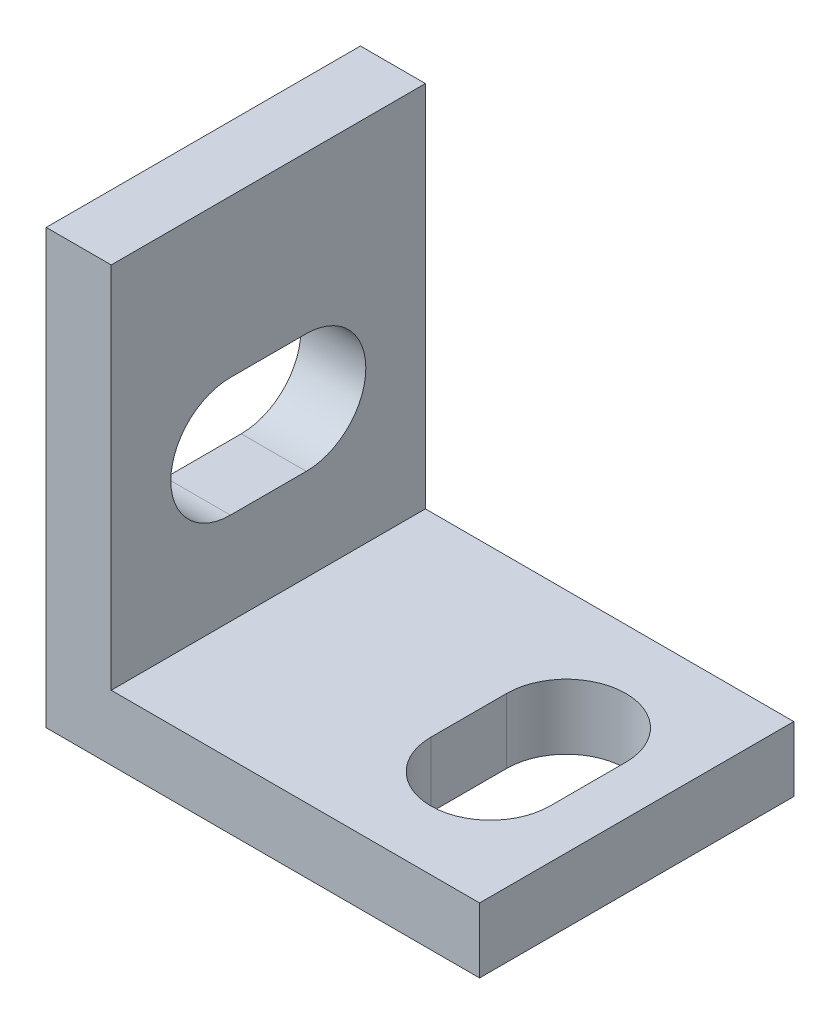
ISO-10303-21;
HEADER;
FILE_DESCRIPTION(('STEP AP214'),'2;1');
FILE_NAME('part.step','',(''),(''),'','','');
FILE_SCHEMA(('AUTOMOTIVE_DESIGN { 1 0 10303 214 1 1 1 1 }'));
ENDSEC;
DATA;
#1=APPLICATION_CONTEXT('core data for automotive mechanical design processes');
#2=APPLICATION_PROTOCOL_DEFINITION('international standard','automotive_design',2000,#1);
#3=PRODUCT_CONTEXT('',#1,'mechanical');
#4=PRODUCT('Part','Part','',(#3));
#5=PRODUCT_RELATED_PRODUCT_CATEGORY('part','',(#4));
#6=PRODUCT_DEFINITION_FORMATION('','',#4);
#7=PRODUCT_DEFINITION_CONTEXT('part definition',#1,'design');
#8=PRODUCT_DEFINITION('design','',#6,#7);
#9=PRODUCT_DEFINITION_SHAPE('','',#8);
#10=(LENGTH_UNIT() NAMED_UNIT(*) SI_UNIT(.MILLI.,.METRE.));
#11=(NAMED_UNIT(*) PLANE_ANGLE_UNIT() SI_UNIT($,.RADIAN.));
#12=(NAMED_UNIT(*) SI_UNIT($,.STERADIAN.) SOLID_ANGLE_UNIT());
#13=UNCERTAINTY_MEASURE_WITH_UNIT(LENGTH_MEASURE(1.E-05),#10,'distance_accuracy_value','');
#14=(GEOMETRIC_REPRESENTATION_CONTEXT(3) GLOBAL_UNCERTAINTY_ASSIGNED_CONTEXT((#13)) GLOBAL_UNIT_ASSIGNED_CONTEXT((#10,
#11,#12)) REPRESENTATION_CONTEXT('',''));
#15=CARTESIAN_POINT('',(0.,0.,0.));
#16=DIRECTION('',(0.,0.,1.));
#17=DIRECTION('',(1.,0.,0.));
#18=AXIS2_PLACEMENT_3D('',#15,#16,#17);
#19=CARTESIAN_POINT('',(0.,0.,14.5));
#20=DIRECTION('',(0.,1.,0.));
#21=DIRECTION('',(0.,0.,1.));
#22=AXIS2_PLACEMENT_3D('',#19,#20,#21);
#23=PLANE('',#22);
#24=DIRECTION('',(0.,0.,1.));
#25=VECTOR('',#24,1.);
#26=CARTESIAN_POINT('',(12.25,0.,9.));
#27=LINE('',#26,#25);
#28=CARTESIAN_POINT('',(12.25,0.,5.5));
#29=VERTEX_POINT('',#28);
#30=CARTESIAN_POINT('',(12.25,0.,9.));
#31=VERTEX_POINT('',#30);
#32=EDGE_CURVE('E142',#29,#31,#27,.T.);
#33=ORIENTED_EDGE('',*,*,#32,.T.);
#34=CARTESIAN_POINT('',(15.,0.,9.));
#35=DIRECTION('',(0.,1.,0.));
#36=DIRECTION('',(0.,0.,1.));
#37=AXIS2_PLACEMENT_3D('',#34,#35,#36);
#38=CIRCLE('',#37,2.75);
#39=CARTESIAN_POINT('',(17.75,0.,9.));
#40=VERTEX_POINT('',#39);
#41=EDGE_CURVE('E136',#31,#40,#38,.T.);
#42=ORIENTED_EDGE('',*,*,#41,.T.);
#43=DIRECTION('',(0.,0.,-1.));
#44=VECTOR('',#43,1.);
#45=CARTESIAN_POINT('',(17.75,0.,9.));
#46=LINE('',#45,#44);
#47=CARTESIAN_POINT('',(17.75,0.,5.5));
#48=VERTEX_POINT('',#47);
#49=EDGE_CURVE('E145',#40,#48,#46,.T.);
#50=ORIENTED_EDGE('',*,*,#49,.T.);
#51=CARTESIAN_POINT('',(15.,0.,5.5));
#52=DIRECTION('',(0.,1.,0.));
#53=DIRECTION('',(0.,0.,1.));
#54=AXIS2_PLACEMENT_3D('',#51,#52,#53);
#55=CIRCLE('',#54,2.75);
#56=EDGE_CURVE('E49',#48,#29,#55,.T.);
#57=ORIENTED_EDGE('',*,*,#56,.T.);
#58=EDGE_LOOP('',(#33,#42,#50,#57));
#59=FACE_BOUND('',#58,.T.);
#60=DIRECTION('',(1.,0.,0.));
#61=VECTOR('',#60,1.);
#62=CARTESIAN_POINT('',(0.,0.,0.));
#63=LINE('',#62,#61);
#64=CARTESIAN_POINT('',(0.,0.,0.));
#65=VERTEX_POINT('',#64);
#66=CARTESIAN_POINT('',(20.,0.,0.));
#67=VERTEX_POINT('',#66);
#68=EDGE_CURVE('E195',#65,#67,#63,.T.);
#69=ORIENTED_EDGE('',*,*,#68,.T.);
#70=DIRECTION('',(0.,0.,-1.));
#71=VECTOR('',#70,1.);
#72=CARTESIAN_POINT('',(20.,0.,14.5));
#73=LINE('',#72,#71);
#74=CARTESIAN_POINT('',(20.,0.,14.5));
#75=VERTEX_POINT('',#74);
#76=EDGE_CURVE('E11',#75,#67,#73,.T.);
#77=ORIENTED_EDGE('',*,*,#76,.F.);
#78=DIRECTION('',(1.,0.,0.));
#79=VECTOR('',#78,1.);
#80=CARTESIAN_POINT('',(0.,0.,14.5));
#81=LINE('',#80,#79);
#82=CARTESIAN_POINT('',(0.,0.,14.5));
#83=VERTEX_POINT('',#82);
#84=EDGE_CURVE('E202',#83,#75,#81,.T.);
#85=ORIENTED_EDGE('',*,*,#84,.F.);
#86=DIRECTION('',(0.,0.,-1.));
#87=VECTOR('',#86,1.);
#88=CARTESIAN_POINT('',(0.,0.,14.5));
#89=LINE('',#88,#87);
#90=EDGE_CURVE('E219',#83,#65,#89,.T.);
#91=ORIENTED_EDGE('',*,*,#90,.T.);
#92=EDGE_LOOP('',(#69,#77,#85,#91));
#93=FACE_BOUND('',#92,.T.);
#94=ADVANCED_FACE('F35',(#59,#93),#23,.F.);
#95=CARTESIAN_POINT('',(20.,3.,14.5));
#96=DIRECTION('',(1.,0.,0.));
#97=DIRECTION('',(0.,0.,-1.));
#98=AXIS2_PLACEMENT_3D('',#95,#96,#97);
#99=PLANE('',#98);
#100=DIRECTION('',(0.,-1.,0.));
#101=VECTOR('',#100,1.);
#102=CARTESIAN_POINT('',(20.,3.,0.));
#103=LINE('',#102,#101);
#104=CARTESIAN_POINT('',(20.,3.,0.));
#105=VERTEX_POINT('',#104);
#106=EDGE_CURVE('E222',#105,#67,#103,.T.);
#107=ORIENTED_EDGE('',*,*,#106,.F.);
#108=DIRECTION('',(0.,0.,-1.));
#109=VECTOR('',#108,1.);
#110=CARTESIAN_POINT('',(20.,3.,14.5));
#111=LINE('',#110,#109);
#112=CARTESIAN_POINT('',(20.,3.,14.5));
#113=VERTEX_POINT('',#112);
#114=EDGE_CURVE('E42',#113,#105,#111,.T.);
#115=ORIENTED_EDGE('',*,*,#114,.F.);
#116=DIRECTION('',(0.,-1.,0.));
#117=VECTOR('',#116,1.);
#118=CARTESIAN_POINT('',(20.,3.,14.5));
#119=LINE('',#118,#117);
#120=EDGE_CURVE('E204',#113,#75,#119,.T.);
#121=ORIENTED_EDGE('',*,*,#120,.T.);
#122=ORIENTED_EDGE('',*,*,#76,.T.);
#123=EDGE_LOOP('',(#107,#115,#121,#122));
#124=FACE_BOUND('',#123,.T.);
#125=ADVANCED_FACE('F249',(#124),#99,.T.);
#126=CARTESIAN_POINT('',(0.,3.,14.5));
#127=DIRECTION('',(0.,1.,0.));
#128=DIRECTION('',(0.,0.,1.));
#129=AXIS2_PLACEMENT_3D('',#126,#127,#128);
#130=PLANE('',#129);
#131=CARTESIAN_POINT('',(15.,3.,9.));
#132=DIRECTION('',(0.,1.,0.));
#133=DIRECTION('',(0.,0.,1.));
#134=AXIS2_PLACEMENT_3D('',#131,#132,#133);
#135=CIRCLE('',#134,2.75);
#136=CARTESIAN_POINT('',(12.25,3.,9.));
#137=VERTEX_POINT('',#136);
#138=CARTESIAN_POINT('',(17.75,3.,9.));
#139=VERTEX_POINT('',#138);
#140=EDGE_CURVE('E57',#137,#139,#135,.T.);
#141=ORIENTED_EDGE('',*,*,#140,.F.);
#142=DIRECTION('',(0.,0.,1.));
#143=VECTOR('',#142,1.);
#144=CARTESIAN_POINT('',(12.25,3.,9.));
#145=LINE('',#144,#143);
#146=CARTESIAN_POINT('',(12.25,3.,5.5));
#147=VERTEX_POINT('',#146);
#148=EDGE_CURVE('E151',#147,#137,#145,.T.);
#149=ORIENTED_EDGE('',*,*,#148,.F.);
#150=CARTESIAN_POINT('',(15.,3.,5.5));
#151=DIRECTION('',(0.,1.,0.));
#152=DIRECTION('',(0.,0.,1.));
#153=AXIS2_PLACEMENT_3D('',#150,#151,#152);
#154=CIRCLE('',#153,2.75);
#155=CARTESIAN_POINT('',(17.75,3.,5.5));
#156=VERTEX_POINT('',#155);
#157=EDGE_CURVE('E154',#156,#147,#154,.T.);
#158=ORIENTED_EDGE('',*,*,#157,.F.);
#159=DIRECTION('',(0.,0.,-1.));
#160=VECTOR('',#159,1.);
#161=CARTESIAN_POINT('',(17.75,3.,9.));
#162=LINE('',#161,#160);
#163=EDGE_CURVE('E160',#139,#156,#162,.T.);
#164=ORIENTED_EDGE('',*,*,#163,.F.);
#165=EDGE_LOOP('',(#141,#149,#158,#164));
#166=FACE_BOUND('',#165,.T.);
#167=DIRECTION('',(1.,0.,0.));
#168=VECTOR('',#167,1.);
#169=CARTESIAN_POINT('',(0.,3.,0.));
#170=LINE('',#169,#168);
#171=CARTESIAN_POINT('',(3.,3.,0.));
#172=VERTEX_POINT('',#171);
#173=EDGE_CURVE('E225',#172,#105,#170,.T.);
#174=ORIENTED_EDGE('',*,*,#173,.F.);
#175=DIRECTION('',(0.,0.,-1.));
#176=VECTOR('',#175,1.);
#177=CARTESIAN_POINT('',(3.,3.,14.5));
#178=LINE('',#177,#176);
#179=CARTESIAN_POINT('',(3.,3.,14.5));
#180=VERTEX_POINT('',#179);
#181=EDGE_CURVE('E241',#180,#172,#178,.T.);
#182=ORIENTED_EDGE('',*,*,#181,.F.);
#183=DIRECTION('',(1.,0.,0.));
#184=VECTOR('',#183,1.);
#185=CARTESIAN_POINT('',(0.,3.,14.5));
#186=LINE('',#185,#184);
#187=EDGE_CURVE('E208',#180,#113,#186,.T.);
#188=ORIENTED_EDGE('',*,*,#187,.T.);
#189=ORIENTED_EDGE('',*,*,#114,.T.);
#190=EDGE_LOOP('',(#174,#182,#188,#189));
#191=FACE_BOUND('',#190,.T.);
#192=ADVANCED_FACE('F245',(#166,#191),#130,.T.);
#193=CARTESIAN_POINT('',(3.,20.,14.5));
#194=DIRECTION('',(1.,0.,0.));
#195=DIRECTION('',(0.,0.,-1.));
#196=AXIS2_PLACEMENT_3D('',#193,#194,#195);
#197=PLANE('',#196);
#198=CARTESIAN_POINT('',(3.,10.,5.5));
#199=DIRECTION('',(1.,0.,0.));
#200=DIRECTION('',(0.,0.,-1.));
#201=AXIS2_PLACEMENT_3D('',#198,#199,#200);
#202=CIRCLE('',#201,2.75);
#203=CARTESIAN_POINT('',(3.,7.25,5.5));
#204=VERTEX_POINT('',#203);
#205=CARTESIAN_POINT('',(3.,12.75,5.5));
#206=VERTEX_POINT('',#205);
#207=EDGE_CURVE('E166',#204,#206,#202,.T.);
#208=ORIENTED_EDGE('',*,*,#207,.F.);
#209=DIRECTION('',(0.,0.,-1.));
#210=VECTOR('',#209,1.);
#211=CARTESIAN_POINT('',(3.,7.25,5.5));
#212=LINE('',#211,#210);
#213=CARTESIAN_POINT('',(3.,7.25,9.));
#214=VERTEX_POINT('',#213);
#215=EDGE_CURVE('E174',#214,#204,#212,.T.);
#216=ORIENTED_EDGE('',*,*,#215,.F.);
#217=CARTESIAN_POINT('',(3.,10.,9.));
#218=DIRECTION('',(1.,0.,0.));
#219=DIRECTION('',(0.,0.,-1.));
#220=AXIS2_PLACEMENT_3D('',#217,#218,#219);
#221=CIRCLE('',#220,2.75);
#222=CARTESIAN_POINT('',(3.,12.75,9.));
#223=VERTEX_POINT('',#222);
#224=EDGE_CURVE('E188',#223,#214,#221,.T.);
#225=ORIENTED_EDGE('',*,*,#224,.F.);
#226=DIRECTION('',(0.,0.,1.));
#227=VECTOR('',#226,1.);
#228=CARTESIAN_POINT('',(3.,12.75,5.5));
#229=LINE('',#228,#227);
#230=EDGE_CURVE('E185',#206,#223,#229,.T.);
#231=ORIENTED_EDGE('',*,*,#230,.F.);
#232=EDGE_LOOP('',(#208,#216,#225,#231));
#233=FACE_BOUND('',#232,.T.);
#234=DIRECTION('',(0.,1.,0.));
#235=VECTOR('',#234,1.);
#236=CARTESIAN_POINT('',(3.,20.,0.));
#237=LINE('',#236,#235);
#238=CARTESIAN_POINT('',(3.,20.,0.));
#239=VERTEX_POINT('',#238);
#240=EDGE_CURVE('E228',#239,#172,#237,.F.);
#241=ORIENTED_EDGE('',*,*,#240,.F.);
#242=DIRECTION('',(0.,0.,-1.));
#243=VECTOR('',#242,1.);
#244=CARTESIAN_POINT('',(3.,20.,14.5));
#245=LINE('',#244,#243);
#246=CARTESIAN_POINT('',(3.,20.,14.5));
#247=VERTEX_POINT('',#246);
#248=EDGE_CURVE('E239',#247,#239,#245,.T.);
#249=ORIENTED_EDGE('',*,*,#248,.F.);
#250=DIRECTION('',(0.,1.,0.));
#251=VECTOR('',#250,1.);
#252=CARTESIAN_POINT('',(3.,20.,14.5));
#253=LINE('',#252,#251);
#254=EDGE_CURVE('E211',#247,#180,#253,.F.);
#255=ORIENTED_EDGE('',*,*,#254,.T.);
#256=ORIENTED_EDGE('',*,*,#181,.T.);
#257=EDGE_LOOP('',(#241,#249,#255,#256));
#258=FACE_BOUND('',#257,.T.);
#259=ADVANCED_FACE('F258',(#233,#258),#197,.T.);
#260=CARTESIAN_POINT('',(0.,20.,14.5));
#261=DIRECTION('',(0.,1.,0.));
#262=DIRECTION('',(0.,0.,1.));
#263=AXIS2_PLACEMENT_3D('',#260,#261,#262);
#264=PLANE('',#263);
#265=DIRECTION('',(1.,0.,0.));
#266=VECTOR('',#265,1.);
#267=CARTESIAN_POINT('',(0.,20.,0.));
#268=LINE('',#267,#266);
#269=CARTESIAN_POINT('',(0.,20.,0.));
#270=VERTEX_POINT('',#269);
#271=EDGE_CURVE('E231',#270,#239,#268,.T.);
#272=ORIENTED_EDGE('',*,*,#271,.F.);
#273=DIRECTION('',(0.,0.,-1.));
#274=VECTOR('',#273,1.);
#275=CARTESIAN_POINT('',(0.,20.,14.5));
#276=LINE('',#275,#274);
#277=CARTESIAN_POINT('',(0.,20.,14.5));
#278=VERTEX_POINT('',#277);
#279=EDGE_CURVE('E237',#278,#270,#276,.T.);
#280=ORIENTED_EDGE('',*,*,#279,.F.);
#281=DIRECTION('',(1.,0.,0.));
#282=VECTOR('',#281,1.);
#283=CARTESIAN_POINT('',(0.,20.,14.5));
#284=LINE('',#283,#282);
#285=EDGE_CURVE('E214',#278,#247,#284,.T.);
#286=ORIENTED_EDGE('',*,*,#285,.T.);
#287=ORIENTED_EDGE('',*,*,#248,.T.);
#288=EDGE_LOOP('',(#272,#280,#286,#287));
#289=FACE_BOUND('',#288,.T.);
#290=ADVANCED_FACE('F268',(#289),#264,.T.);
#291=CARTESIAN_POINT('',(0.,20.,14.5));
#292=DIRECTION('',(1.,0.,0.));
#293=DIRECTION('',(0.,0.,-1.));
#294=AXIS2_PLACEMENT_3D('',#291,#292,#293);
#295=PLANE('',#294);
#296=DIRECTION('',(0.,0.,-1.));
#297=VECTOR('',#296,1.);
#298=CARTESIAN_POINT('',(0.,7.25,5.5));
#299=LINE('',#298,#297);
#300=CARTESIAN_POINT('',(0.,7.25,9.));
#301=VERTEX_POINT('',#300);
#302=CARTESIAN_POINT('',(0.,7.25,5.5));
#303=VERTEX_POINT('',#302);
#304=EDGE_CURVE('E180',#301,#303,#299,.T.);
#305=ORIENTED_EDGE('',*,*,#304,.T.);
#306=CARTESIAN_POINT('',(0.,10.,5.5));
#307=DIRECTION('',(1.,0.,0.));
#308=DIRECTION('',(0.,0.,-1.));
#309=AXIS2_PLACEMENT_3D('',#306,#307,#308);
#310=CIRCLE('',#309,2.75);
#311=CARTESIAN_POINT('',(0.,12.75,5.5));
#312=VERTEX_POINT('',#311);
#313=EDGE_CURVE('E170',#303,#312,#310,.T.);
#314=ORIENTED_EDGE('',*,*,#313,.T.);
#315=DIRECTION('',(0.,0.,1.));
#316=VECTOR('',#315,1.);
#317=CARTESIAN_POINT('',(0.,12.75,5.5));
#318=LINE('',#317,#316);
#319=CARTESIAN_POINT('',(0.,12.75,9.));
#320=VERTEX_POINT('',#319);
#321=EDGE_CURVE('E173',#312,#320,#318,.T.);
#322=ORIENTED_EDGE('',*,*,#321,.T.);
#323=CARTESIAN_POINT('',(0.,10.,9.));
#324=DIRECTION('',(1.,0.,0.));
#325=DIRECTION('',(0.,0.,-1.));
#326=AXIS2_PLACEMENT_3D('',#323,#324,#325);
#327=CIRCLE('',#326,2.75);
#328=EDGE_CURVE('E177',#320,#301,#327,.T.);
#329=ORIENTED_EDGE('',*,*,#328,.T.);
#330=EDGE_LOOP('',(#305,#314,#322,#329));
#331=FACE_BOUND('',#330,.T.);
#332=DIRECTION('',(0.,-1.,0.));
#333=VECTOR('',#332,1.);
#334=CARTESIAN_POINT('',(0.,20.,0.));
#335=LINE('',#334,#333);
#336=EDGE_CURVE('E205',#270,#65,#335,.T.);
#337=ORIENTED_EDGE('',*,*,#336,.T.);
#338=ORIENTED_EDGE('',*,*,#90,.F.);
#339=DIRECTION('',(0.,-1.,0.));
#340=VECTOR('',#339,1.);
#341=CARTESIAN_POINT('',(0.,20.,14.5));
#342=LINE('',#341,#340);
#343=EDGE_CURVE('E217',#278,#83,#342,.T.);
#344=ORIENTED_EDGE('',*,*,#343,.F.);
#345=ORIENTED_EDGE('',*,*,#279,.T.);
#346=EDGE_LOOP('',(#337,#338,#344,#345));
#347=FACE_BOUND('',#346,.T.);
#348=ADVANCED_FACE('F269',(#331,#347),#295,.F.);
#349=CARTESIAN_POINT('',(0.,0.,14.5));
#350=DIRECTION('',(0.,0.,-1.));
#351=DIRECTION('',(-1.,0.,0.));
#352=AXIS2_PLACEMENT_3D('',#349,#350,#351);
#353=PLANE('',#352);
#354=ORIENTED_EDGE('',*,*,#84,.T.);
#355=ORIENTED_EDGE('',*,*,#120,.F.);
#356=ORIENTED_EDGE('',*,*,#187,.F.);
#357=ORIENTED_EDGE('',*,*,#254,.F.);
#358=ORIENTED_EDGE('',*,*,#285,.F.);
#359=ORIENTED_EDGE('',*,*,#343,.T.);
#360=EDGE_LOOP('',(#354,#355,#356,#357,#358,#359));
#361=FACE_BOUND('',#360,.T.);
#362=ADVANCED_FACE('F261',(#361),#353,.F.);
#363=CARTESIAN_POINT('',(0.,0.,0.));
#364=DIRECTION('',(0.,0.,-1.));
#365=DIRECTION('',(-1.,0.,0.));
#366=AXIS2_PLACEMENT_3D('',#363,#364,#365);
#367=PLANE('',#366);
#368=ORIENTED_EDGE('',*,*,#68,.F.);
#369=ORIENTED_EDGE('',*,*,#336,.F.);
#370=ORIENTED_EDGE('',*,*,#271,.T.);
#371=ORIENTED_EDGE('',*,*,#240,.T.);
#372=ORIENTED_EDGE('',*,*,#173,.T.);
#373=ORIENTED_EDGE('',*,*,#106,.T.);
#374=EDGE_LOOP('',(#368,#369,#370,#371,#372,#373));
#375=FACE_BOUND('',#374,.T.);
#376=ADVANCED_FACE('F253',(#375),#367,.T.);
#377=CARTESIAN_POINT('',(0.,10.,5.5));
#378=DIRECTION('',(1.,0.,0.));
#379=DIRECTION('',(0.,0.,-1.));
#380=AXIS2_PLACEMENT_3D('',#377,#378,#379);
#381=CYLINDRICAL_SURFACE('',#380,2.75);
#382=ORIENTED_EDGE('',*,*,#207,.T.);
#383=DIRECTION('',(1.,0.,0.));
#384=VECTOR('',#383,1.);
#385=CARTESIAN_POINT('',(0.,12.75,5.5));
#386=LINE('',#385,#384);
#387=EDGE_CURVE('E183',#312,#206,#386,.T.);
#388=ORIENTED_EDGE('',*,*,#387,.F.);
#389=ORIENTED_EDGE('',*,*,#313,.F.);
#390=DIRECTION('',(1.,0.,0.));
#391=VECTOR('',#390,1.);
#392=CARTESIAN_POINT('',(0.,7.25,5.5));
#393=LINE('',#392,#391);
#394=EDGE_CURVE('E193',#303,#204,#393,.T.);
#395=ORIENTED_EDGE('',*,*,#394,.T.);
#396=EDGE_LOOP('',(#382,#388,#389,#395));
#397=FACE_BOUND('',#396,.T.);
#398=ADVANCED_FACE('F299',(#397),#381,.F.);
#399=CARTESIAN_POINT('',(0.,7.25,5.5));
#400=DIRECTION('',(0.,-1.,0.));
#401=DIRECTION('',(0.,0.,-1.));
#402=AXIS2_PLACEMENT_3D('',#399,#400,#401);
#403=PLANE('',#402);
#404=ORIENTED_EDGE('',*,*,#215,.T.);
#405=ORIENTED_EDGE('',*,*,#394,.F.);
#406=ORIENTED_EDGE('',*,*,#304,.F.);
#407=DIRECTION('',(1.,0.,0.));
#408=VECTOR('',#407,1.);
#409=CARTESIAN_POINT('',(0.,7.25,9.));
#410=LINE('',#409,#408);
#411=EDGE_CURVE('E196',#301,#214,#410,.T.);
#412=ORIENTED_EDGE('',*,*,#411,.T.);
#413=EDGE_LOOP('',(#404,#405,#406,#412));
#414=FACE_BOUND('',#413,.T.);
#415=ADVANCED_FACE('F307',(#414),#403,.F.);
#416=CARTESIAN_POINT('',(0.,10.,9.));
#417=DIRECTION('',(1.,0.,0.));
#418=DIRECTION('',(0.,0.,-1.));
#419=AXIS2_PLACEMENT_3D('',#416,#417,#418);
#420=CYLINDRICAL_SURFACE('',#419,2.75);
#421=ORIENTED_EDGE('',*,*,#224,.T.);
#422=ORIENTED_EDGE('',*,*,#411,.F.);
#423=ORIENTED_EDGE('',*,*,#328,.F.);
#424=DIRECTION('',(1.,0.,0.));
#425=VECTOR('',#424,1.);
#426=CARTESIAN_POINT('',(0.,12.75,9.));
#427=LINE('',#426,#425);
#428=EDGE_CURVE('E198',#320,#223,#427,.T.);
#429=ORIENTED_EDGE('',*,*,#428,.T.);
#430=EDGE_LOOP('',(#421,#422,#423,#429));
#431=FACE_BOUND('',#430,.T.);
#432=ADVANCED_FACE('F309',(#431),#420,.F.);
#433=CARTESIAN_POINT('',(0.,12.75,5.5));
#434=DIRECTION('',(0.,1.,0.));
#435=DIRECTION('',(0.,0.,1.));
#436=AXIS2_PLACEMENT_3D('',#433,#434,#435);
#437=PLANE('',#436);
#438=ORIENTED_EDGE('',*,*,#230,.T.);
#439=ORIENTED_EDGE('',*,*,#428,.F.);
#440=ORIENTED_EDGE('',*,*,#321,.F.);
#441=ORIENTED_EDGE('',*,*,#387,.T.);
#442=EDGE_LOOP('',(#438,#439,#440,#441));
#443=FACE_BOUND('',#442,.T.);
#444=ADVANCED_FACE('F303',(#443),#437,.F.);
#445=CARTESIAN_POINT('',(15.,0.,9.));
#446=DIRECTION('',(0.,1.,0.));
#447=DIRECTION('',(0.,0.,1.));
#448=AXIS2_PLACEMENT_3D('',#445,#446,#447);
#449=CYLINDRICAL_SURFACE('',#448,2.75);
#450=ORIENTED_EDGE('',*,*,#140,.T.);
#451=DIRECTION('',(0.,1.,0.));
#452=VECTOR('',#451,1.);
#453=CARTESIAN_POINT('',(17.75,0.,9.));
#454=LINE('',#453,#452);
#455=EDGE_CURVE('E132',#40,#139,#454,.T.);
#456=ORIENTED_EDGE('',*,*,#455,.F.);
#457=ORIENTED_EDGE('',*,*,#41,.F.);
#458=DIRECTION('',(0.,1.,0.));
#459=VECTOR('',#458,1.);
#460=CARTESIAN_POINT('',(12.25,0.,9.));
#461=LINE('',#460,#459);
#462=EDGE_CURVE('E164',#31,#137,#461,.T.);
#463=ORIENTED_EDGE('',*,*,#462,.T.);
#464=EDGE_LOOP('',(#450,#456,#457,#463));
#465=FACE_BOUND('',#464,.T.);
#466=ADVANCED_FACE('F134',(#465),#449,.F.);
#467=CARTESIAN_POINT('',(12.25,0.,9.));
#468=DIRECTION('',(-1.,0.,0.));
#469=DIRECTION('',(0.,0.,1.));
#470=AXIS2_PLACEMENT_3D('',#467,#468,#469);
#471=PLANE('',#470);
#472=ORIENTED_EDGE('',*,*,#148,.T.);
#473=ORIENTED_EDGE('',*,*,#462,.F.);
#474=ORIENTED_EDGE('',*,*,#32,.F.);
#475=DIRECTION('',(0.,1.,0.));
#476=VECTOR('',#475,1.);
#477=CARTESIAN_POINT('',(12.25,0.,5.5));
#478=LINE('',#477,#476);
#479=EDGE_CURVE('E167',#29,#147,#478,.T.);
#480=ORIENTED_EDGE('',*,*,#479,.T.);
#481=EDGE_LOOP('',(#472,#473,#474,#480));
#482=FACE_BOUND('',#481,.T.);
#483=ADVANCED_FACE('F365',(#482),#471,.F.);
#484=CARTESIAN_POINT('',(15.,0.,5.5));
#485=DIRECTION('',(0.,1.,0.));
#486=DIRECTION('',(0.,0.,1.));
#487=AXIS2_PLACEMENT_3D('',#484,#485,#486);
#488=CYLINDRICAL_SURFACE('',#487,2.75);
#489=ORIENTED_EDGE('',*,*,#157,.T.);
#490=ORIENTED_EDGE('',*,*,#479,.F.);
#491=ORIENTED_EDGE('',*,*,#56,.F.);
#492=DIRECTION('',(0.,1.,0.));
#493=VECTOR('',#492,1.);
#494=CARTESIAN_POINT('',(17.75,0.,5.5));
#495=LINE('',#494,#493);
#496=EDGE_CURVE('E141',#48,#156,#495,.T.);
#497=ORIENTED_EDGE('',*,*,#496,.T.);
#498=EDGE_LOOP('',(#489,#490,#491,#497));
#499=FACE_BOUND('',#498,.T.);
#500=ADVANCED_FACE('F373',(#499),#488,.F.);
#501=CARTESIAN_POINT('',(17.75,0.,9.));
#502=DIRECTION('',(1.,0.,0.));
#503=DIRECTION('',(0.,0.,-1.));
#504=AXIS2_PLACEMENT_3D('',#501,#502,#503);
#505=PLANE('',#504);
#506=ORIENTED_EDGE('',*,*,#163,.T.);
#507=ORIENTED_EDGE('',*,*,#496,.F.);
#508=ORIENTED_EDGE('',*,*,#49,.F.);
#509=ORIENTED_EDGE('',*,*,#455,.T.);
#510=EDGE_LOOP('',(#506,#507,#508,#509));
#511=FACE_BOUND('',#510,.T.);
#512=ADVANCED_FACE('F146',(#511),#505,.F.);
#513=CLOSED_SHELL('',(#94,#125,#192,#259,#290,#348,#362,#376,#398,#415,#432,#444,#466,#483,#500,#512));
#514=MANIFOLD_SOLID_BREP('B2',#513);
#515=ADVANCED_BREP_SHAPE_REPRESENTATION('',(#18,#514),#14);
#516=SHAPE_DEFINITION_REPRESENTATION(#9,#515);
ENDSEC;
END-ISO-10303-21;
